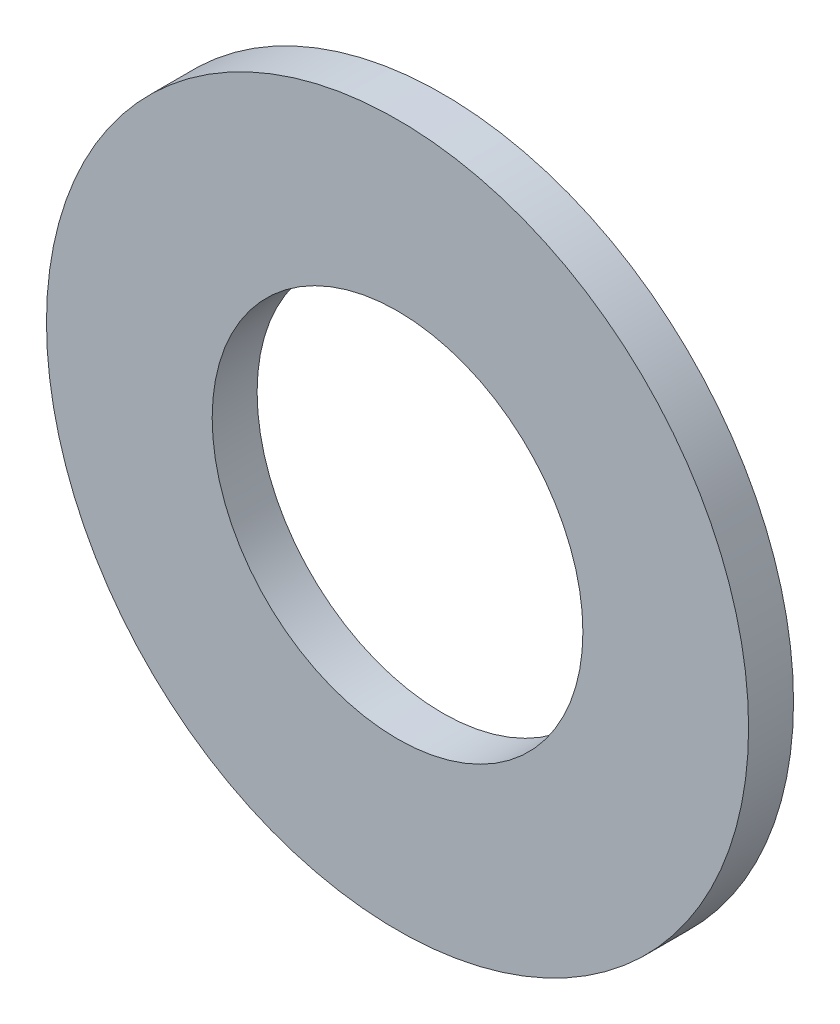
ISO-10303-21;
HEADER;
FILE_DESCRIPTION(('STEP AP214'),'2;1');
FILE_NAME('part.step','',(''),(''),'','','');
FILE_SCHEMA(('AUTOMOTIVE_DESIGN { 1 0 10303 214 1 1 1 1 }'));
ENDSEC;
DATA;
#1=APPLICATION_CONTEXT('core data for automotive mechanical design processes');
#2=APPLICATION_PROTOCOL_DEFINITION('international standard','automotive_design',2000,#1);
#3=PRODUCT_CONTEXT('',#1,'mechanical');
#4=PRODUCT('Part','Part','',(#3));
#5=PRODUCT_RELATED_PRODUCT_CATEGORY('part','',(#4));
#6=PRODUCT_DEFINITION_FORMATION('','',#4);
#7=PRODUCT_DEFINITION_CONTEXT('part definition',#1,'design');
#8=PRODUCT_DEFINITION('design','',#6,#7);
#9=PRODUCT_DEFINITION_SHAPE('','',#8);
#10=(LENGTH_UNIT() NAMED_UNIT(*) SI_UNIT(.MILLI.,.METRE.));
#11=(NAMED_UNIT(*) PLANE_ANGLE_UNIT() SI_UNIT($,.RADIAN.));
#12=(NAMED_UNIT(*) SI_UNIT($,.STERADIAN.) SOLID_ANGLE_UNIT());
#13=UNCERTAINTY_MEASURE_WITH_UNIT(LENGTH_MEASURE(1.E-05),#10,'distance_accuracy_value','');
#14=(GEOMETRIC_REPRESENTATION_CONTEXT(3) GLOBAL_UNCERTAINTY_ASSIGNED_CONTEXT((#13)) GLOBAL_UNIT_ASSIGNED_CONTEXT((#10,
#11,#12)) REPRESENTATION_CONTEXT('',''));
#15=CARTESIAN_POINT('',(0.,0.,0.));
#16=DIRECTION('',(0.,0.,1.));
#17=DIRECTION('',(1.,0.,0.));
#18=AXIS2_PLACEMENT_3D('',#15,#16,#17);
#19=CARTESIAN_POINT('',(0.,0.,0.8128));
#20=DIRECTION('',(0.,0.,1.));
#21=DIRECTION('',(1.,0.,0.));
#22=AXIS2_PLACEMENT_3D('',#19,#20,#21);
#23=PLANE('',#22);
#24=CARTESIAN_POINT('',(0.,0.,0.8128));
#25=DIRECTION('',(0.,0.,1.));
#26=DIRECTION('',(1.,0.,0.));
#27=AXIS2_PLACEMENT_3D('',#24,#25,#26);
#28=CIRCLE('',#27,6.35);
#29=CARTESIAN_POINT('',(6.35,0.,0.8128));
#30=VERTEX_POINT('',#29);
#31=EDGE_CURVE('E10',#30,#30,#28,.T.);
#32=ORIENTED_EDGE('',*,*,#31,.T.);
#33=EDGE_LOOP('',(#32));
#34=FACE_BOUND('',#33,.T.);
#35=CARTESIAN_POINT('',(0.,0.,0.8128));
#36=DIRECTION('',(0.,0.,1.));
#37=DIRECTION('',(1.,0.,0.));
#38=AXIS2_PLACEMENT_3D('',#35,#36,#37);
#39=CIRCLE('',#38,3.3528);
#40=CARTESIAN_POINT('',(3.3528,0.,0.8128));
#41=VERTEX_POINT('',#40);
#42=EDGE_CURVE('E50',#41,#41,#39,.T.);
#43=ORIENTED_EDGE('',*,*,#42,.F.);
#44=EDGE_LOOP('',(#43));
#45=FACE_BOUND('',#44,.T.);
#46=ADVANCED_FACE('F39',(#34,#45),#23,.T.);
#47=CARTESIAN_POINT('',(0.,0.,0.));
#48=DIRECTION('',(0.,0.,1.));
#49=DIRECTION('',(1.,0.,0.));
#50=AXIS2_PLACEMENT_3D('',#47,#48,#49);
#51=PLANE('',#50);
#52=CARTESIAN_POINT('',(0.,0.,0.));
#53=DIRECTION('',(0.,0.,1.));
#54=DIRECTION('',(1.,0.,0.));
#55=AXIS2_PLACEMENT_3D('',#52,#53,#54);
#56=CIRCLE('',#55,6.35);
#57=CARTESIAN_POINT('',(6.35,0.,0.));
#58=VERTEX_POINT('',#57);
#59=EDGE_CURVE('E43',#58,#58,#56,.T.);
#60=ORIENTED_EDGE('',*,*,#59,.F.);
#61=EDGE_LOOP('',(#60));
#62=FACE_BOUND('',#61,.T.);
#63=CARTESIAN_POINT('',(0.,0.,0.));
#64=DIRECTION('',(0.,0.,1.));
#65=DIRECTION('',(1.,0.,0.));
#66=AXIS2_PLACEMENT_3D('',#63,#64,#65);
#67=CIRCLE('',#66,3.3528);
#68=CARTESIAN_POINT('',(3.3528,0.,0.));
#69=VERTEX_POINT('',#68);
#70=EDGE_CURVE('E52',#69,#69,#67,.T.);
#71=ORIENTED_EDGE('',*,*,#70,.T.);
#72=EDGE_LOOP('',(#71));
#73=FACE_BOUND('',#72,.T.);
#74=ADVANCED_FACE('F62',(#62,#73),#51,.F.);
#75=CARTESIAN_POINT('',(0.,0.,0.8128));
#76=DIRECTION('',(0.,0.,-1.));
#77=DIRECTION('',(-1.,0.,0.));
#78=AXIS2_PLACEMENT_3D('',#75,#76,#77);
#79=CYLINDRICAL_SURFACE('',#78,6.35);
#80=ORIENTED_EDGE('',*,*,#31,.F.);
#81=EDGE_LOOP('',(#80));
#82=FACE_BOUND('',#81,.T.);
#83=ORIENTED_EDGE('',*,*,#59,.T.);
#84=EDGE_LOOP('',(#83));
#85=FACE_BOUND('',#84,.T.);
#86=ADVANCED_FACE('F41',(#82,#85),#79,.T.);
#87=CARTESIAN_POINT('',(0.,0.,0.8128));
#88=DIRECTION('',(0.,0.,-1.));
#89=DIRECTION('',(-1.,0.,0.));
#90=AXIS2_PLACEMENT_3D('',#87,#88,#89);
#91=CYLINDRICAL_SURFACE('',#90,3.3528);
#92=ORIENTED_EDGE('',*,*,#42,.T.);
#93=EDGE_LOOP('',(#92));
#94=FACE_BOUND('',#93,.T.);
#95=ORIENTED_EDGE('',*,*,#70,.F.);
#96=EDGE_LOOP('',(#95));
#97=FACE_BOUND('',#96,.T.);
#98=ADVANCED_FACE('F58',(#94,#97),#91,.F.);
#99=CLOSED_SHELL('',(#46,#74,#86,#98));
#100=MANIFOLD_SOLID_BREP('B2',#99);
#101=ADVANCED_BREP_SHAPE_REPRESENTATION('',(#18,#100),#14);
#102=SHAPE_DEFINITION_REPRESENTATION(#9,#101);
ENDSEC;
END-ISO-10303-21;
